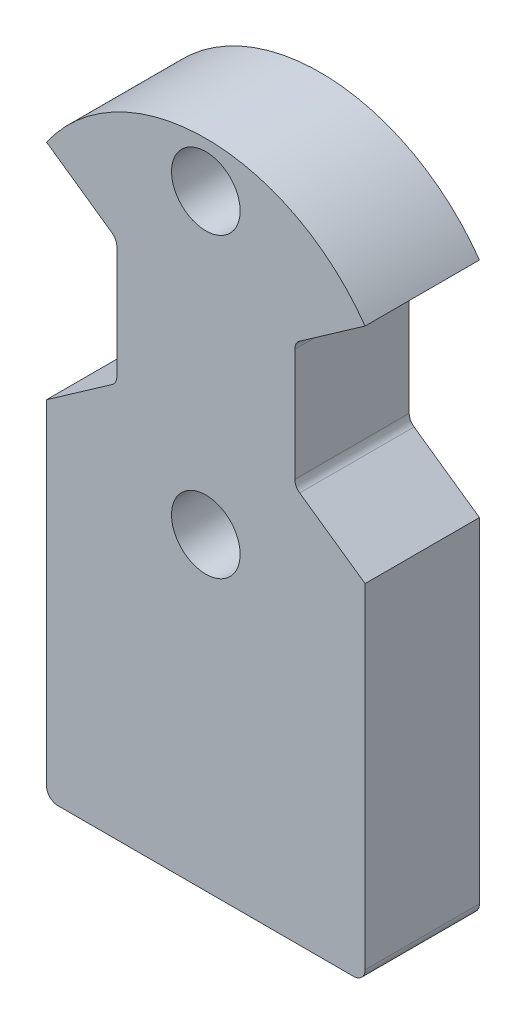
ISO-10303-21;
HEADER;
FILE_DESCRIPTION(('STEP AP214'),'2;1');
FILE_NAME('part.step','',(''),(''),'','','');
FILE_SCHEMA(('AUTOMOTIVE_DESIGN { 1 0 10303 214 1 1 1 1 }'));
ENDSEC;
DATA;
#1=APPLICATION_CONTEXT('core data for automotive mechanical design processes');
#2=APPLICATION_PROTOCOL_DEFINITION('international standard','automotive_design',2000,#1);
#3=PRODUCT_CONTEXT('',#1,'mechanical');
#4=PRODUCT('Part','Part','',(#3));
#5=PRODUCT_RELATED_PRODUCT_CATEGORY('part','',(#4));
#6=PRODUCT_DEFINITION_FORMATION('','',#4);
#7=PRODUCT_DEFINITION_CONTEXT('part definition',#1,'design');
#8=PRODUCT_DEFINITION('design','',#6,#7);
#9=PRODUCT_DEFINITION_SHAPE('','',#8);
#10=(LENGTH_UNIT() NAMED_UNIT(*) SI_UNIT(.MILLI.,.METRE.));
#11=(NAMED_UNIT(*) PLANE_ANGLE_UNIT() SI_UNIT($,.RADIAN.));
#12=(NAMED_UNIT(*) SI_UNIT($,.STERADIAN.) SOLID_ANGLE_UNIT());
#13=UNCERTAINTY_MEASURE_WITH_UNIT(LENGTH_MEASURE(1.E-05),#10,'distance_accuracy_value','');
#14=(GEOMETRIC_REPRESENTATION_CONTEXT(3) GLOBAL_UNCERTAINTY_ASSIGNED_CONTEXT((#13)) GLOBAL_UNIT_ASSIGNED_CONTEXT((#10,
#11,#12)) REPRESENTATION_CONTEXT('',''));
#15=CARTESIAN_POINT('',(0.,0.,0.));
#16=DIRECTION('',(0.,0.,1.));
#17=DIRECTION('',(1.,0.,0.));
#18=AXIS2_PLACEMENT_3D('',#15,#16,#17);
#19=CARTESIAN_POINT('',(0.,0.,5.));
#20=DIRECTION('',(0.,0.,1.));
#21=DIRECTION('',(1.,0.,0.));
#22=AXIS2_PLACEMENT_3D('',#19,#20,#21);
#23=PLANE('',#22);
#24=DIRECTION('',(0.,1.,0.));
#25=VECTOR('',#24,1.);
#26=CARTESIAN_POINT('',(-3.89097221037271,0.,5.));
#27=LINE('',#26,#25);
#28=CARTESIAN_POINT('',(-3.89097221037271,-2.4642045473916,5.));
#29=VERTEX_POINT('',#28);
#30=CARTESIAN_POINT('',(-3.89097221037271,2.4642045473916,5.));
#31=VERTEX_POINT('',#30);
#32=EDGE_CURVE('E185',#29,#31,#27,.T.);
#33=ORIENTED_EDGE('',*,*,#32,.F.);
#34=CARTESIAN_POINT('',(-4.39097221037271,-2.4642045473916,5.));
#35=DIRECTION('',(0.,0.,1.));
#36=DIRECTION('',(1.,0.,0.));
#37=AXIS2_PLACEMENT_3D('',#34,#35,#36);
#38=CIRCLE('',#37,0.5);
#39=CARTESIAN_POINT('',(-4.10418399219718,-2.8737805695361,5.));
#40=VERTEX_POINT('',#39);
#41=EDGE_CURVE('E271',#29,#40,#38,.F.);
#42=ORIENTED_EDGE('',*,*,#41,.T.);
#43=DIRECTION('',(-0.819152044288991,-0.573576436351047,0.));
#44=VECTOR('',#43,1.);
#45=CARTESIAN_POINT('',(0.,0.,5.));
#46=LINE('',#45,#44);
#47=CARTESIAN_POINT('',(-6.96279237645642,-4.8753997089839,5.));
#48=VERTEX_POINT('',#47);
#49=EDGE_CURVE('E199',#40,#48,#46,.T.);
#50=ORIENTED_EDGE('',*,*,#49,.T.);
#51=DIRECTION('',(0.,-1.,0.));
#52=VECTOR('',#51,1.);
#53=CARTESIAN_POINT('',(-6.96279237645642,0.,5.));
#54=LINE('',#53,#52);
#55=CARTESIAN_POINT('',(-6.96279237645642,-19.5,5.));
#56=VERTEX_POINT('',#55);
#57=EDGE_CURVE('E182',#48,#56,#54,.T.);
#58=ORIENTED_EDGE('',*,*,#57,.T.);
#59=CARTESIAN_POINT('',(-6.46279237645642,-19.5,5.));
#60=DIRECTION('',(0.,0.,1.));
#61=DIRECTION('',(1.,0.,0.));
#62=AXIS2_PLACEMENT_3D('',#59,#60,#61);
#63=CIRCLE('',#62,0.5);
#64=CARTESIAN_POINT('',(-6.46279237645642,-20.,5.));
#65=VERTEX_POINT('',#64);
#66=EDGE_CURVE('E237',#56,#65,#63,.T.);
#67=ORIENTED_EDGE('',*,*,#66,.T.);
#68=DIRECTION('',(-1.,0.,0.));
#69=VECTOR('',#68,1.);
#70=CARTESIAN_POINT('',(0.,-20.,5.));
#71=LINE('',#70,#69);
#72=CARTESIAN_POINT('',(6.46279237645642,-20.,5.));
#73=VERTEX_POINT('',#72);
#74=EDGE_CURVE('E191',#73,#65,#71,.T.);
#75=ORIENTED_EDGE('',*,*,#74,.F.);
#76=CARTESIAN_POINT('',(6.46279237645642,-19.5,5.));
#77=DIRECTION('',(0.,0.,1.));
#78=DIRECTION('',(1.,0.,0.));
#79=AXIS2_PLACEMENT_3D('',#76,#77,#78);
#80=CIRCLE('',#79,0.5);
#81=CARTESIAN_POINT('',(6.96279237645642,-19.5,5.));
#82=VERTEX_POINT('',#81);
#83=EDGE_CURVE('E239',#73,#82,#80,.T.);
#84=ORIENTED_EDGE('',*,*,#83,.T.);
#85=DIRECTION('',(0.,-1.,0.));
#86=VECTOR('',#85,1.);
#87=CARTESIAN_POINT('',(6.96279237645642,0.,5.));
#88=LINE('',#87,#86);
#89=CARTESIAN_POINT('',(6.96279237645642,-4.8753997089839,5.));
#90=VERTEX_POINT('',#89);
#91=EDGE_CURVE('E302',#90,#82,#88,.T.);
#92=ORIENTED_EDGE('',*,*,#91,.F.);
#93=DIRECTION('',(0.819152044288991,-0.573576436351047,0.));
#94=VECTOR('',#93,1.);
#95=CARTESIAN_POINT('',(0.,0.,5.));
#96=LINE('',#95,#94);
#97=CARTESIAN_POINT('',(4.10418399219718,-2.8737805695361,5.));
#98=VERTEX_POINT('',#97);
#99=EDGE_CURVE('E168',#98,#90,#96,.T.);
#100=ORIENTED_EDGE('',*,*,#99,.F.);
#101=CARTESIAN_POINT('',(4.39097221037271,-2.4642045473916,5.));
#102=DIRECTION('',(0.,0.,1.));
#103=DIRECTION('',(1.,0.,0.));
#104=AXIS2_PLACEMENT_3D('',#101,#102,#103);
#105=CIRCLE('',#104,0.5);
#106=CARTESIAN_POINT('',(3.89097221037271,-2.4642045473916,5.));
#107=VERTEX_POINT('',#106);
#108=EDGE_CURVE('E267',#98,#107,#105,.F.);
#109=ORIENTED_EDGE('',*,*,#108,.T.);
#110=DIRECTION('',(0.,1.,0.));
#111=VECTOR('',#110,1.);
#112=CARTESIAN_POINT('',(3.89097221037271,0.,5.));
#113=LINE('',#112,#111);
#114=CARTESIAN_POINT('',(3.89097221037271,2.4642045473916,5.));
#115=VERTEX_POINT('',#114);
#116=EDGE_CURVE('E293',#107,#115,#113,.T.);
#117=ORIENTED_EDGE('',*,*,#116,.T.);
#118=CARTESIAN_POINT('',(4.39097221037271,2.4642045473916,5.));
#119=DIRECTION('',(0.,0.,1.));
#120=DIRECTION('',(1.,0.,0.));
#121=AXIS2_PLACEMENT_3D('',#118,#119,#120);
#122=CIRCLE('',#121,0.5);
#123=CARTESIAN_POINT('',(4.10418399219718,2.8737805695361,5.));
#124=VERTEX_POINT('',#123);
#125=EDGE_CURVE('E264',#115,#124,#122,.F.);
#126=ORIENTED_EDGE('',*,*,#125,.T.);
#127=DIRECTION('',(0.819152044288991,0.573576436351047,0.));
#128=VECTOR('',#127,1.);
#129=CARTESIAN_POINT('',(0.,0.,5.));
#130=LINE('',#129,#128);
#131=CARTESIAN_POINT('',(6.96279237645642,4.8753997089839,5.));
#132=VERTEX_POINT('',#131);
#133=EDGE_CURVE('E161',#124,#132,#130,.T.);
#134=ORIENTED_EDGE('',*,*,#133,.T.);
#135=CARTESIAN_POINT('',(0.,0.,5.));
#136=DIRECTION('',(0.,0.,1.));
#137=DIRECTION('',(1.,0.,0.));
#138=AXIS2_PLACEMENT_3D('',#135,#136,#137);
#139=CIRCLE('',#138,8.5);
#140=CARTESIAN_POINT('',(-6.96279237645642,4.8753997089839,5.));
#141=VERTEX_POINT('',#140);
#142=EDGE_CURVE('E222',#132,#141,#139,.T.);
#143=ORIENTED_EDGE('',*,*,#142,.T.);
#144=DIRECTION('',(-0.819152044288991,0.573576436351047,0.));
#145=VECTOR('',#144,1.);
#146=CARTESIAN_POINT('',(0.,0.,5.));
#147=LINE('',#146,#145);
#148=CARTESIAN_POINT('',(-4.10418399219718,2.8737805695361,5.));
#149=VERTEX_POINT('',#148);
#150=EDGE_CURVE('E201',#149,#141,#147,.T.);
#151=ORIENTED_EDGE('',*,*,#150,.F.);
#152=CARTESIAN_POINT('',(-4.39097221037271,2.4642045473916,5.));
#153=DIRECTION('',(0.,0.,1.));
#154=DIRECTION('',(1.,0.,0.));
#155=AXIS2_PLACEMENT_3D('',#152,#153,#154);
#156=CIRCLE('',#155,0.5);
#157=EDGE_CURVE('E11',#149,#31,#156,.F.);
#158=ORIENTED_EDGE('',*,*,#157,.T.);
#159=EDGE_LOOP('',(#33,#42,#50,#58,#67,#75,#84,#92,#100,#109,#117,#126,#134,#143,#151,#158));
#160=FACE_BOUND('',#159,.T.);
#161=CARTESIAN_POINT('',(0.,6.5,5.));
#162=DIRECTION('',(0.,0.,1.));
#163=DIRECTION('',(1.,0.,0.));
#164=AXIS2_PLACEMENT_3D('',#161,#162,#163);
#165=CIRCLE('',#164,1.5);
#166=CARTESIAN_POINT('',(1.5,6.5,5.));
#167=VERTEX_POINT('',#166);
#168=EDGE_CURVE('E214',#167,#167,#165,.T.);
#169=ORIENTED_EDGE('',*,*,#168,.F.);
#170=EDGE_LOOP('',(#169));
#171=FACE_BOUND('',#170,.T.);
#172=CARTESIAN_POINT('',(0.,-6.5,5.));
#173=DIRECTION('',(0.,0.,1.));
#174=DIRECTION('',(1.,0.,0.));
#175=AXIS2_PLACEMENT_3D('',#172,#173,#174);
#176=CIRCLE('',#175,1.5);
#177=CARTESIAN_POINT('',(1.5,-6.5,5.));
#178=VERTEX_POINT('',#177);
#179=EDGE_CURVE('E209',#178,#178,#176,.T.);
#180=ORIENTED_EDGE('',*,*,#179,.F.);
#181=EDGE_LOOP('',(#180));
#182=FACE_BOUND('',#181,.T.);
#183=ADVANCED_FACE('F41',(#160,#171,#182),#23,.T.);
#184=CARTESIAN_POINT('',(0.,0.,0.));
#185=DIRECTION('',(0.,0.,1.));
#186=DIRECTION('',(1.,0.,0.));
#187=AXIS2_PLACEMENT_3D('',#184,#185,#186);
#188=PLANE('',#187);
#189=CARTESIAN_POINT('',(0.,-6.5,0.));
#190=DIRECTION('',(0.,0.,1.));
#191=DIRECTION('',(1.,0.,0.));
#192=AXIS2_PLACEMENT_3D('',#189,#190,#191);
#193=CIRCLE('',#192,1.5);
#194=CARTESIAN_POINT('',(1.5,-6.5,0.));
#195=VERTEX_POINT('',#194);
#196=EDGE_CURVE('E217',#195,#195,#193,.T.);
#197=ORIENTED_EDGE('',*,*,#196,.T.);
#198=EDGE_LOOP('',(#197));
#199=FACE_BOUND('',#198,.T.);
#200=CARTESIAN_POINT('',(0.,6.5,0.));
#201=DIRECTION('',(0.,0.,1.));
#202=DIRECTION('',(1.,0.,0.));
#203=AXIS2_PLACEMENT_3D('',#200,#201,#202);
#204=CIRCLE('',#203,1.5);
#205=CARTESIAN_POINT('',(1.5,6.5,0.));
#206=VERTEX_POINT('',#205);
#207=EDGE_CURVE('E210',#206,#206,#204,.T.);
#208=ORIENTED_EDGE('',*,*,#207,.T.);
#209=EDGE_LOOP('',(#208));
#210=FACE_BOUND('',#209,.T.);
#211=DIRECTION('',(-0.819152044288991,-0.573576436351047,0.));
#212=VECTOR('',#211,1.);
#213=CARTESIAN_POINT('',(0.,0.,0.));
#214=LINE('',#213,#212);
#215=CARTESIAN_POINT('',(-4.10418399219718,-2.8737805695361,0.));
#216=VERTEX_POINT('',#215);
#217=CARTESIAN_POINT('',(-6.96279237645642,-4.8753997089839,0.));
#218=VERTEX_POINT('',#217);
#219=EDGE_CURVE('E198',#216,#218,#214,.T.);
#220=ORIENTED_EDGE('',*,*,#219,.F.);
#221=CARTESIAN_POINT('',(-4.39097221037271,-2.4642045473916,0.));
#222=DIRECTION('',(0.,0.,1.));
#223=DIRECTION('',(1.,0.,0.));
#224=AXIS2_PLACEMENT_3D('',#221,#222,#223);
#225=CIRCLE('',#224,0.5);
#226=CARTESIAN_POINT('',(-3.89097221037271,-2.4642045473916,0.));
#227=VERTEX_POINT('',#226);
#228=EDGE_CURVE('E269',#216,#227,#225,.T.);
#229=ORIENTED_EDGE('',*,*,#228,.T.);
#230=DIRECTION('',(0.,-1.,0.));
#231=VECTOR('',#230,1.);
#232=CARTESIAN_POINT('',(-3.89097221037271,0.,0.));
#233=LINE('',#232,#231);
#234=CARTESIAN_POINT('',(-3.89097221037271,2.4642045473916,0.));
#235=VERTEX_POINT('',#234);
#236=EDGE_CURVE('E288',#235,#227,#233,.T.);
#237=ORIENTED_EDGE('',*,*,#236,.F.);
#238=CARTESIAN_POINT('',(-4.39097221037271,2.4642045473916,0.));
#239=DIRECTION('',(0.,0.,1.));
#240=DIRECTION('',(1.,0.,0.));
#241=AXIS2_PLACEMENT_3D('',#238,#239,#240);
#242=CIRCLE('',#241,0.5);
#243=CARTESIAN_POINT('',(-4.10418399219718,2.8737805695361,0.));
#244=VERTEX_POINT('',#243);
#245=EDGE_CURVE('E49',#235,#244,#242,.T.);
#246=ORIENTED_EDGE('',*,*,#245,.T.);
#247=DIRECTION('',(-0.819152044288991,0.573576436351047,0.));
#248=VECTOR('',#247,1.);
#249=CARTESIAN_POINT('',(0.,0.,0.));
#250=LINE('',#249,#248);
#251=CARTESIAN_POINT('',(-6.96279237645642,4.8753997089839,0.));
#252=VERTEX_POINT('',#251);
#253=EDGE_CURVE('E202',#244,#252,#250,.T.);
#254=ORIENTED_EDGE('',*,*,#253,.T.);
#255=CARTESIAN_POINT('',(0.,0.,0.));
#256=DIRECTION('',(0.,0.,1.));
#257=DIRECTION('',(1.,0.,0.));
#258=AXIS2_PLACEMENT_3D('',#255,#256,#257);
#259=CIRCLE('',#258,8.5);
#260=CARTESIAN_POINT('',(6.96279237645642,4.8753997089839,0.));
#261=VERTEX_POINT('',#260);
#262=EDGE_CURVE('E213',#261,#252,#259,.T.);
#263=ORIENTED_EDGE('',*,*,#262,.F.);
#264=DIRECTION('',(0.819152044288991,0.573576436351047,0.));
#265=VECTOR('',#264,1.);
#266=CARTESIAN_POINT('',(0.,0.,0.));
#267=LINE('',#266,#265);
#268=CARTESIAN_POINT('',(4.10418399219718,2.8737805695361,0.));
#269=VERTEX_POINT('',#268);
#270=EDGE_CURVE('E162',#269,#261,#267,.T.);
#271=ORIENTED_EDGE('',*,*,#270,.F.);
#272=CARTESIAN_POINT('',(4.39097221037271,2.4642045473916,0.));
#273=DIRECTION('',(0.,0.,1.));
#274=DIRECTION('',(1.,0.,0.));
#275=AXIS2_PLACEMENT_3D('',#272,#273,#274);
#276=CIRCLE('',#275,0.5);
#277=CARTESIAN_POINT('',(3.89097221037271,2.4642045473916,0.));
#278=VERTEX_POINT('',#277);
#279=EDGE_CURVE('E262',#269,#278,#276,.T.);
#280=ORIENTED_EDGE('',*,*,#279,.T.);
#281=DIRECTION('',(0.,-1.,0.));
#282=VECTOR('',#281,1.);
#283=CARTESIAN_POINT('',(3.89097221037271,0.,0.));
#284=LINE('',#283,#282);
#285=CARTESIAN_POINT('',(3.89097221037271,-2.4642045473916,0.));
#286=VERTEX_POINT('',#285);
#287=EDGE_CURVE('E294',#278,#286,#284,.T.);
#288=ORIENTED_EDGE('',*,*,#287,.T.);
#289=CARTESIAN_POINT('',(4.39097221037271,-2.4642045473916,0.));
#290=DIRECTION('',(0.,0.,1.));
#291=DIRECTION('',(1.,0.,0.));
#292=AXIS2_PLACEMENT_3D('',#289,#290,#291);
#293=CIRCLE('',#292,0.5);
#294=CARTESIAN_POINT('',(4.10418399219718,-2.8737805695361,0.));
#295=VERTEX_POINT('',#294);
#296=EDGE_CURVE('E158',#286,#295,#293,.T.);
#297=ORIENTED_EDGE('',*,*,#296,.T.);
#298=DIRECTION('',(0.819152044288991,-0.573576436351047,0.));
#299=VECTOR('',#298,1.);
#300=CARTESIAN_POINT('',(0.,0.,0.));
#301=LINE('',#300,#299);
#302=CARTESIAN_POINT('',(6.96279237645643,-4.8753997089839,0.));
#303=VERTEX_POINT('',#302);
#304=EDGE_CURVE('E151',#295,#303,#301,.T.);
#305=ORIENTED_EDGE('',*,*,#304,.T.);
#306=DIRECTION('',(0.,-1.,0.));
#307=VECTOR('',#306,1.);
#308=CARTESIAN_POINT('',(6.96279237645642,0.,0.));
#309=LINE('',#308,#307);
#310=CARTESIAN_POINT('',(6.96279237645642,-19.5,0.));
#311=VERTEX_POINT('',#310);
#312=EDGE_CURVE('E156',#303,#311,#309,.T.);
#313=ORIENTED_EDGE('',*,*,#312,.T.);
#314=CARTESIAN_POINT('',(6.46279237645642,-19.5,0.));
#315=DIRECTION('',(0.,0.,1.));
#316=DIRECTION('',(1.,0.,0.));
#317=AXIS2_PLACEMENT_3D('',#314,#315,#316);
#318=CIRCLE('',#317,0.5);
#319=CARTESIAN_POINT('',(6.46279237645642,-20.,0.));
#320=VERTEX_POINT('',#319);
#321=EDGE_CURVE('E230',#311,#320,#318,.F.);
#322=ORIENTED_EDGE('',*,*,#321,.T.);
#323=DIRECTION('',(-1.,0.,0.));
#324=VECTOR('',#323,1.);
#325=CARTESIAN_POINT('',(0.,-20.,0.));
#326=LINE('',#325,#324);
#327=CARTESIAN_POINT('',(-6.46279237645642,-20.,0.));
#328=VERTEX_POINT('',#327);
#329=EDGE_CURVE('E178',#320,#328,#326,.T.);
#330=ORIENTED_EDGE('',*,*,#329,.T.);
#331=CARTESIAN_POINT('',(-6.46279237645642,-19.5,0.));
#332=DIRECTION('',(0.,0.,1.));
#333=DIRECTION('',(1.,0.,0.));
#334=AXIS2_PLACEMENT_3D('',#331,#332,#333);
#335=CIRCLE('',#334,0.5);
#336=CARTESIAN_POINT('',(-6.96279237645642,-19.5,0.));
#337=VERTEX_POINT('',#336);
#338=EDGE_CURVE('E228',#328,#337,#335,.F.);
#339=ORIENTED_EDGE('',*,*,#338,.T.);
#340=DIRECTION('',(0.,-1.,0.));
#341=VECTOR('',#340,1.);
#342=CARTESIAN_POINT('',(-6.96279237645642,0.,0.));
#343=LINE('',#342,#341);
#344=EDGE_CURVE('E179',#218,#337,#343,.T.);
#345=ORIENTED_EDGE('',*,*,#344,.F.);
#346=EDGE_LOOP('',(#220,#229,#237,#246,#254,#263,#271,#280,#288,#297,#305,#313,#322,#330,#339,#345));
#347=FACE_BOUND('',#346,.T.);
#348=ADVANCED_FACE('F154',(#199,#210,#347),#188,.F.);
#349=CARTESIAN_POINT('',(0.,0.,5.));
#350=DIRECTION('',(0.,0.,-1.));
#351=DIRECTION('',(-1.,0.,0.));
#352=AXIS2_PLACEMENT_3D('',#349,#350,#351);
#353=CYLINDRICAL_SURFACE('',#352,8.5);
#354=ORIENTED_EDGE('',*,*,#142,.F.);
#355=DIRECTION('',(0.,0.,-1.));
#356=VECTOR('',#355,1.);
#357=CARTESIAN_POINT('',(6.96279237645642,4.8753997089839,5.));
#358=LINE('',#357,#356);
#359=EDGE_CURVE('E194',#132,#261,#358,.T.);
#360=ORIENTED_EDGE('',*,*,#359,.T.);
#361=ORIENTED_EDGE('',*,*,#262,.T.);
#362=DIRECTION('',(0.,0.,-1.));
#363=VECTOR('',#362,1.);
#364=CARTESIAN_POINT('',(-6.96279237645642,4.8753997089839,5.));
#365=LINE('',#364,#363);
#366=EDGE_CURVE('E204',#141,#252,#365,.T.);
#367=ORIENTED_EDGE('',*,*,#366,.F.);
#368=EDGE_LOOP('',(#354,#360,#361,#367));
#369=FACE_BOUND('',#368,.T.);
#370=ADVANCED_FACE('F335',(#369),#353,.T.);
#371=CARTESIAN_POINT('',(0.,-6.5,0.));
#372=DIRECTION('',(0.,0.,1.));
#373=DIRECTION('',(1.,0.,0.));
#374=AXIS2_PLACEMENT_3D('',#371,#372,#373);
#375=CYLINDRICAL_SURFACE('',#374,1.5);
#376=ORIENTED_EDGE('',*,*,#196,.F.);
#377=EDGE_LOOP('',(#376));
#378=FACE_BOUND('',#377,.T.);
#379=ORIENTED_EDGE('',*,*,#179,.T.);
#380=EDGE_LOOP('',(#379));
#381=FACE_BOUND('',#380,.T.);
#382=ADVANCED_FACE('F339',(#378,#381),#375,.F.);
#383=CARTESIAN_POINT('',(0.,6.5,0.));
#384=DIRECTION('',(0.,0.,1.));
#385=DIRECTION('',(1.,0.,0.));
#386=AXIS2_PLACEMENT_3D('',#383,#384,#385);
#387=CYLINDRICAL_SURFACE('',#386,1.5);
#388=ORIENTED_EDGE('',*,*,#207,.F.);
#389=EDGE_LOOP('',(#388));
#390=FACE_BOUND('',#389,.T.);
#391=ORIENTED_EDGE('',*,*,#168,.T.);
#392=EDGE_LOOP('',(#391));
#393=FACE_BOUND('',#392,.T.);
#394=ADVANCED_FACE('F425',(#390,#393),#387,.F.);
#395=CARTESIAN_POINT('',(0.,0.,5.));
#396=DIRECTION('',(-0.573576436351047,-0.819152044288991,0.));
#397=DIRECTION('',(0.819152044288991,-0.573576436351047,0.));
#398=AXIS2_PLACEMENT_3D('',#395,#396,#397);
#399=PLANE('',#398);
#400=ORIENTED_EDGE('',*,*,#253,.F.);
#401=DIRECTION('',(0.,0.,-1.));
#402=VECTOR('',#401,1.);
#403=CARTESIAN_POINT('',(-4.10418399219718,2.8737805695361,5.));
#404=LINE('',#403,#402);
#405=EDGE_CURVE('E56',#244,#149,#404,.F.);
#406=ORIENTED_EDGE('',*,*,#405,.T.);
#407=ORIENTED_EDGE('',*,*,#150,.T.);
#408=ORIENTED_EDGE('',*,*,#366,.T.);
#409=EDGE_LOOP('',(#400,#406,#407,#408));
#410=FACE_BOUND('',#409,.T.);
#411=ADVANCED_FACE('F369',(#410),#399,.T.);
#412=CARTESIAN_POINT('',(0.,0.,5.));
#413=DIRECTION('',(0.573576436351047,-0.819152044288991,0.));
#414=DIRECTION('',(0.819152044288991,0.573576436351047,0.));
#415=AXIS2_PLACEMENT_3D('',#412,#413,#414);
#416=PLANE('',#415);
#417=ORIENTED_EDGE('',*,*,#49,.F.);
#418=DIRECTION('',(0.,0.,-1.));
#419=VECTOR('',#418,1.);
#420=CARTESIAN_POINT('',(-4.10418399219718,-2.8737805695361,0.));
#421=LINE('',#420,#419);
#422=EDGE_CURVE('E253',#40,#216,#421,.T.);
#423=ORIENTED_EDGE('',*,*,#422,.T.);
#424=ORIENTED_EDGE('',*,*,#219,.T.);
#425=DIRECTION('',(0.,0.,-1.));
#426=VECTOR('',#425,1.);
#427=CARTESIAN_POINT('',(-6.96279237645642,-4.8753997089839,5.));
#428=LINE('',#427,#426);
#429=EDGE_CURVE('E172',#48,#218,#428,.T.);
#430=ORIENTED_EDGE('',*,*,#429,.F.);
#431=EDGE_LOOP('',(#417,#423,#424,#430));
#432=FACE_BOUND('',#431,.T.);
#433=ADVANCED_FACE('F284',(#432),#416,.F.);
#434=CARTESIAN_POINT('',(0.,0.,5.));
#435=DIRECTION('',(0.573576436351047,0.819152044288991,0.));
#436=DIRECTION('',(-0.819152044288991,0.573576436351047,0.));
#437=AXIS2_PLACEMENT_3D('',#434,#435,#436);
#438=PLANE('',#437);
#439=ORIENTED_EDGE('',*,*,#304,.F.);
#440=DIRECTION('',(0.,0.,-1.));
#441=VECTOR('',#440,1.);
#442=CARTESIAN_POINT('',(4.10418399219718,-2.8737805695361,5.));
#443=LINE('',#442,#441);
#444=EDGE_CURVE('E251',#295,#98,#443,.F.);
#445=ORIENTED_EDGE('',*,*,#444,.T.);
#446=ORIENTED_EDGE('',*,*,#99,.T.);
#447=DIRECTION('',(0.,0.,-1.));
#448=VECTOR('',#447,1.);
#449=CARTESIAN_POINT('',(6.96279237645643,-4.8753997089839,5.));
#450=LINE('',#449,#448);
#451=EDGE_CURVE('E165',#90,#303,#450,.T.);
#452=ORIENTED_EDGE('',*,*,#451,.T.);
#453=EDGE_LOOP('',(#439,#445,#446,#452));
#454=FACE_BOUND('',#453,.T.);
#455=ADVANCED_FACE('F166',(#454),#438,.T.);
#456=CARTESIAN_POINT('',(0.,0.,5.));
#457=DIRECTION('',(-0.573576436351047,0.819152044288991,0.));
#458=DIRECTION('',(-0.819152044288991,-0.573576436351047,0.));
#459=AXIS2_PLACEMENT_3D('',#456,#457,#458);
#460=PLANE('',#459);
#461=ORIENTED_EDGE('',*,*,#133,.F.);
#462=DIRECTION('',(0.,0.,-1.));
#463=VECTOR('',#462,1.);
#464=CARTESIAN_POINT('',(4.10418399219718,2.8737805695361,5.));
#465=LINE('',#464,#463);
#466=EDGE_CURVE('E243',#124,#269,#465,.T.);
#467=ORIENTED_EDGE('',*,*,#466,.T.);
#468=ORIENTED_EDGE('',*,*,#270,.T.);
#469=ORIENTED_EDGE('',*,*,#359,.F.);
#470=EDGE_LOOP('',(#461,#467,#468,#469));
#471=FACE_BOUND('',#470,.T.);
#472=ADVANCED_FACE('F318',(#471),#460,.F.);
#473=CARTESIAN_POINT('',(-6.96279237645642,0.,5.));
#474=DIRECTION('',(1.,0.,0.));
#475=DIRECTION('',(0.,0.,-1.));
#476=AXIS2_PLACEMENT_3D('',#473,#474,#475);
#477=PLANE('',#476);
#478=ORIENTED_EDGE('',*,*,#344,.T.);
#479=DIRECTION('',(0.,0.,-1.));
#480=VECTOR('',#479,1.);
#481=CARTESIAN_POINT('',(-6.96279237645642,-19.5,5.));
#482=LINE('',#481,#480);
#483=EDGE_CURVE('E241',#337,#56,#482,.F.);
#484=ORIENTED_EDGE('',*,*,#483,.T.);
#485=ORIENTED_EDGE('',*,*,#57,.F.);
#486=ORIENTED_EDGE('',*,*,#429,.T.);
#487=EDGE_LOOP('',(#478,#484,#485,#486));
#488=FACE_BOUND('',#487,.T.);
#489=ADVANCED_FACE('F316',(#488),#477,.F.);
#490=CARTESIAN_POINT('',(0.,-20.,5.));
#491=DIRECTION('',(0.,-1.,0.));
#492=DIRECTION('',(0.,0.,-1.));
#493=AXIS2_PLACEMENT_3D('',#490,#491,#492);
#494=PLANE('',#493);
#495=ORIENTED_EDGE('',*,*,#329,.F.);
#496=DIRECTION('',(0.,0.,-1.));
#497=VECTOR('',#496,1.);
#498=CARTESIAN_POINT('',(6.46279237645642,-20.,5.));
#499=LINE('',#498,#497);
#500=EDGE_CURVE('E235',#320,#73,#499,.F.);
#501=ORIENTED_EDGE('',*,*,#500,.T.);
#502=ORIENTED_EDGE('',*,*,#74,.T.);
#503=DIRECTION('',(0.,0.,-1.));
#504=VECTOR('',#503,1.);
#505=CARTESIAN_POINT('',(-6.46279237645642,-20.,0.));
#506=LINE('',#505,#504);
#507=EDGE_CURVE('E232',#65,#328,#506,.T.);
#508=ORIENTED_EDGE('',*,*,#507,.T.);
#509=EDGE_LOOP('',(#495,#501,#502,#508));
#510=FACE_BOUND('',#509,.T.);
#511=ADVANCED_FACE('F308',(#510),#494,.T.);
#512=CARTESIAN_POINT('',(6.96279237645642,0.,5.));
#513=DIRECTION('',(1.,0.,0.));
#514=DIRECTION('',(0.,0.,-1.));
#515=AXIS2_PLACEMENT_3D('',#512,#513,#514);
#516=PLANE('',#515);
#517=ORIENTED_EDGE('',*,*,#91,.T.);
#518=DIRECTION('',(0.,0.,-1.));
#519=VECTOR('',#518,1.);
#520=CARTESIAN_POINT('',(6.96279237645642,-19.5,5.));
#521=LINE('',#520,#519);
#522=EDGE_CURVE('E177',#82,#311,#521,.T.);
#523=ORIENTED_EDGE('',*,*,#522,.T.);
#524=ORIENTED_EDGE('',*,*,#312,.F.);
#525=ORIENTED_EDGE('',*,*,#451,.F.);
#526=EDGE_LOOP('',(#517,#523,#524,#525));
#527=FACE_BOUND('',#526,.T.);
#528=ADVANCED_FACE('F175',(#527),#516,.T.);
#529=CARTESIAN_POINT('',(6.46279237645642,-19.5,5.));
#530=DIRECTION('',(0.,0.,-1.));
#531=DIRECTION('',(-1.,0.,0.));
#532=AXIS2_PLACEMENT_3D('',#529,#530,#531);
#533=CYLINDRICAL_SURFACE('',#532,0.5);
#534=ORIENTED_EDGE('',*,*,#83,.F.);
#535=ORIENTED_EDGE('',*,*,#500,.F.);
#536=ORIENTED_EDGE('',*,*,#321,.F.);
#537=ORIENTED_EDGE('',*,*,#522,.F.);
#538=EDGE_LOOP('',(#534,#535,#536,#537));
#539=FACE_BOUND('',#538,.T.);
#540=ADVANCED_FACE('F345',(#539),#533,.T.);
#541=CARTESIAN_POINT('',(-6.46279237645642,-19.5,5.));
#542=DIRECTION('',(0.,0.,1.));
#543=DIRECTION('',(1.,0.,0.));
#544=AXIS2_PLACEMENT_3D('',#541,#542,#543);
#545=CYLINDRICAL_SURFACE('',#544,0.5);
#546=ORIENTED_EDGE('',*,*,#66,.F.);
#547=ORIENTED_EDGE('',*,*,#483,.F.);
#548=ORIENTED_EDGE('',*,*,#338,.F.);
#549=ORIENTED_EDGE('',*,*,#507,.F.);
#550=EDGE_LOOP('',(#546,#547,#548,#549));
#551=FACE_BOUND('',#550,.T.);
#552=ADVANCED_FACE('F313',(#551),#545,.T.);
#553=CARTESIAN_POINT('',(3.89097221037271,0.,10.));
#554=DIRECTION('',(1.,0.,0.));
#555=DIRECTION('',(0.,0.,-1.));
#556=AXIS2_PLACEMENT_3D('',#553,#554,#555);
#557=PLANE('',#556);
#558=ORIENTED_EDGE('',*,*,#287,.F.);
#559=DIRECTION('',(0.,0.,-1.));
#560=VECTOR('',#559,1.);
#561=CARTESIAN_POINT('',(3.89097221037271,2.4642045473916,10.));
#562=LINE('',#561,#560);
#563=EDGE_CURVE('E249',#278,#115,#562,.F.);
#564=ORIENTED_EDGE('',*,*,#563,.T.);
#565=ORIENTED_EDGE('',*,*,#116,.F.);
#566=DIRECTION('',(0.,0.,-1.));
#567=VECTOR('',#566,1.);
#568=CARTESIAN_POINT('',(3.89097221037271,-2.4642045473916,0.));
#569=LINE('',#568,#567);
#570=EDGE_CURVE('E246',#107,#286,#569,.T.);
#571=ORIENTED_EDGE('',*,*,#570,.T.);
#572=EDGE_LOOP('',(#558,#564,#565,#571));
#573=FACE_BOUND('',#572,.T.);
#574=ADVANCED_FACE('F351',(#573),#557,.T.);
#575=CARTESIAN_POINT('',(-3.89097221037271,0.,10.));
#576=DIRECTION('',(1.,0.,0.));
#577=DIRECTION('',(0.,0.,-1.));
#578=AXIS2_PLACEMENT_3D('',#575,#576,#577);
#579=PLANE('',#578);
#580=ORIENTED_EDGE('',*,*,#236,.T.);
#581=DIRECTION('',(0.,0.,-1.));
#582=VECTOR('',#581,1.);
#583=CARTESIAN_POINT('',(-3.89097221037271,-2.4642045473916,5.));
#584=LINE('',#583,#582);
#585=EDGE_CURVE('E259',#227,#29,#584,.F.);
#586=ORIENTED_EDGE('',*,*,#585,.T.);
#587=ORIENTED_EDGE('',*,*,#32,.T.);
#588=DIRECTION('',(0.,0.,-1.));
#589=VECTOR('',#588,1.);
#590=CARTESIAN_POINT('',(-3.89097221037271,2.4642045473916,10.));
#591=LINE('',#590,#589);
#592=EDGE_CURVE('E256',#31,#235,#591,.T.);
#593=ORIENTED_EDGE('',*,*,#592,.T.);
#594=EDGE_LOOP('',(#580,#586,#587,#593));
#595=FACE_BOUND('',#594,.T.);
#596=ADVANCED_FACE('F291',(#595),#579,.F.);
#597=CARTESIAN_POINT('',(4.39097221037271,2.4642045473916,5.));
#598=DIRECTION('',(0.,0.,-1.));
#599=DIRECTION('',(-1.,0.,0.));
#600=AXIS2_PLACEMENT_3D('',#597,#598,#599);
#601=CYLINDRICAL_SURFACE('',#600,0.5);
#602=ORIENTED_EDGE('',*,*,#125,.F.);
#603=ORIENTED_EDGE('',*,*,#563,.F.);
#604=ORIENTED_EDGE('',*,*,#279,.F.);
#605=ORIENTED_EDGE('',*,*,#466,.F.);
#606=EDGE_LOOP('',(#602,#603,#604,#605));
#607=FACE_BOUND('',#606,.T.);
#608=ADVANCED_FACE('F352',(#607),#601,.F.);
#609=CARTESIAN_POINT('',(4.39097221037271,-2.4642045473916,10.));
#610=DIRECTION('',(0.,0.,1.));
#611=DIRECTION('',(1.,0.,0.));
#612=AXIS2_PLACEMENT_3D('',#609,#610,#611);
#613=CYLINDRICAL_SURFACE('',#612,0.5);
#614=ORIENTED_EDGE('',*,*,#108,.F.);
#615=ORIENTED_EDGE('',*,*,#444,.F.);
#616=ORIENTED_EDGE('',*,*,#296,.F.);
#617=ORIENTED_EDGE('',*,*,#570,.F.);
#618=EDGE_LOOP('',(#614,#615,#616,#617));
#619=FACE_BOUND('',#618,.T.);
#620=ADVANCED_FACE('F355',(#619),#613,.F.);
#621=CARTESIAN_POINT('',(-4.39097221037271,-2.4642045473916,5.));
#622=DIRECTION('',(0.,0.,1.));
#623=DIRECTION('',(1.,0.,0.));
#624=AXIS2_PLACEMENT_3D('',#621,#622,#623);
#625=CYLINDRICAL_SURFACE('',#624,0.5);
#626=ORIENTED_EDGE('',*,*,#41,.F.);
#627=ORIENTED_EDGE('',*,*,#585,.F.);
#628=ORIENTED_EDGE('',*,*,#228,.F.);
#629=ORIENTED_EDGE('',*,*,#422,.F.);
#630=EDGE_LOOP('',(#626,#627,#628,#629));
#631=FACE_BOUND('',#630,.T.);
#632=ADVANCED_FACE('F286',(#631),#625,.F.);
#633=CARTESIAN_POINT('',(-4.39097221037271,2.4642045473916,10.));
#634=DIRECTION('',(0.,0.,-1.));
#635=DIRECTION('',(-1.,0.,0.));
#636=AXIS2_PLACEMENT_3D('',#633,#634,#635);
#637=CYLINDRICAL_SURFACE('',#636,0.5);
#638=ORIENTED_EDGE('',*,*,#157,.F.);
#639=ORIENTED_EDGE('',*,*,#405,.F.);
#640=ORIENTED_EDGE('',*,*,#245,.F.);
#641=ORIENTED_EDGE('',*,*,#592,.F.);
#642=EDGE_LOOP('',(#638,#639,#640,#641));
#643=FACE_BOUND('',#642,.T.);
#644=ADVANCED_FACE('F43',(#643),#637,.F.);
#645=CLOSED_SHELL('',(#183,#348,#370,#382,#394,#411,#433,#455,#472,#489,#511,#528,#540,#552,
#574,#596,#608,#620,#632,#644));
#646=MANIFOLD_SOLID_BREP('B2',#645);
#647=ADVANCED_BREP_SHAPE_REPRESENTATION('',(#18,#646),#14);
#648=SHAPE_DEFINITION_REPRESENTATION(#9,#647);
ENDSEC;
END-ISO-10303-21;
